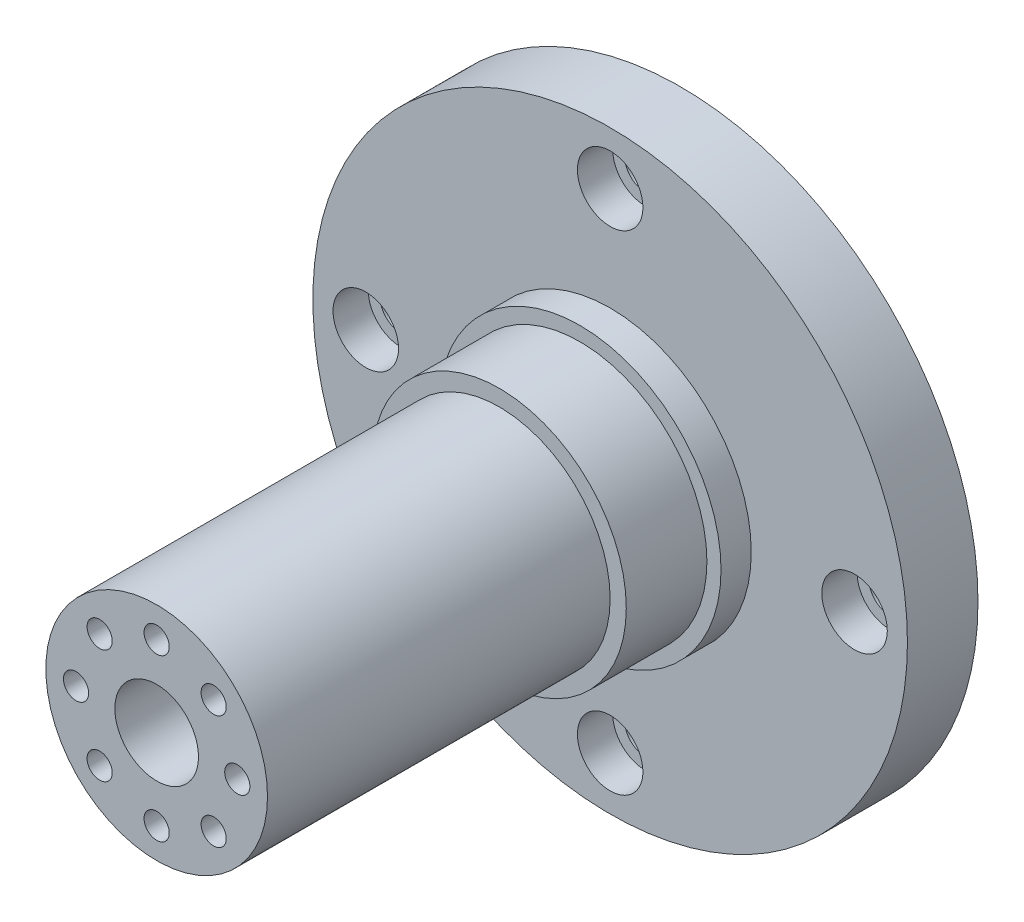
ISO-10303-21;
HEADER;
FILE_DESCRIPTION(('STEP AP214'),'2;1');
FILE_NAME('part.step','',(''),(''),'','','');
FILE_SCHEMA(('AUTOMOTIVE_DESIGN { 1 0 10303 214 1 1 1 1 }'));
ENDSEC;
DATA;
#1=APPLICATION_CONTEXT('core data for automotive mechanical design processes');
#2=APPLICATION_PROTOCOL_DEFINITION('international standard','automotive_design',2000,#1);
#3=PRODUCT_CONTEXT('',#1,'mechanical');
#4=PRODUCT('Part','Part','',(#3));
#5=PRODUCT_RELATED_PRODUCT_CATEGORY('part','',(#4));
#6=PRODUCT_DEFINITION_FORMATION('','',#4);
#7=PRODUCT_DEFINITION_CONTEXT('part definition',#1,'design');
#8=PRODUCT_DEFINITION('design','',#6,#7);
#9=PRODUCT_DEFINITION_SHAPE('','',#8);
#10=(LENGTH_UNIT() NAMED_UNIT(*) SI_UNIT(.MILLI.,.METRE.));
#11=(NAMED_UNIT(*) PLANE_ANGLE_UNIT() SI_UNIT($,.RADIAN.));
#12=(NAMED_UNIT(*) SI_UNIT($,.STERADIAN.) SOLID_ANGLE_UNIT());
#13=UNCERTAINTY_MEASURE_WITH_UNIT(LENGTH_MEASURE(1.E-05),#10,'distance_accuracy_value','');
#14=(GEOMETRIC_REPRESENTATION_CONTEXT(3) GLOBAL_UNCERTAINTY_ASSIGNED_CONTEXT((#13)) GLOBAL_UNIT_ASSIGNED_CONTEXT((#10,
#11,#12)) REPRESENTATION_CONTEXT('',''));
#15=CARTESIAN_POINT('',(0.,0.,0.));
#16=DIRECTION('',(0.,0.,1.));
#17=DIRECTION('',(1.,0.,0.));
#18=AXIS2_PLACEMENT_3D('',#15,#16,#17);
#19=CARTESIAN_POINT('',(0.,0.,7.));
#20=DIRECTION('',(0.,0.,-1.));
#21=DIRECTION('',(-1.,0.,0.));
#22=AXIS2_PLACEMENT_3D('',#19,#20,#21);
#23=CYLINDRICAL_SURFACE('',#22,29.5);
#24=CARTESIAN_POINT('',(0.,0.,7.));
#25=DIRECTION('',(0.,0.,1.));
#26=DIRECTION('',(1.,0.,0.));
#27=AXIS2_PLACEMENT_3D('',#24,#25,#26);
#28=CIRCLE('',#27,29.5);
#29=CARTESIAN_POINT('',(29.5,0.,7.));
#30=VERTEX_POINT('',#29);
#31=EDGE_CURVE('E73',#30,#30,#28,.T.);
#32=ORIENTED_EDGE('',*,*,#31,.F.);
#33=EDGE_LOOP('',(#32));
#34=FACE_BOUND('',#33,.T.);
#35=CARTESIAN_POINT('',(0.,0.,0.));
#36=DIRECTION('',(0.,0.,1.));
#37=DIRECTION('',(1.,0.,0.));
#38=AXIS2_PLACEMENT_3D('',#35,#36,#37);
#39=CIRCLE('',#38,29.5);
#40=CARTESIAN_POINT('',(29.5,0.,0.));
#41=VERTEX_POINT('',#40);
#42=EDGE_CURVE('E46',#41,#41,#39,.T.);
#43=ORIENTED_EDGE('',*,*,#42,.T.);
#44=EDGE_LOOP('',(#43));
#45=FACE_BOUND('',#44,.T.);
#46=ADVANCED_FACE('F43',(#34,#45),#23,.T.);
#47=CARTESIAN_POINT('',(0.,0.,7.));
#48=DIRECTION('',(0.,0.,1.));
#49=DIRECTION('',(1.,0.,0.));
#50=AXIS2_PLACEMENT_3D('',#47,#48,#49);
#51=PLANE('',#50);
#52=CARTESIAN_POINT('',(-24.25,0.,7.));
#53=DIRECTION('',(0.,0.,1.));
#54=DIRECTION('',(1.,0.,0.));
#55=AXIS2_PLACEMENT_3D('',#52,#53,#54);
#56=CIRCLE('',#55,3.25);
#57=CARTESIAN_POINT('',(-21.,0.,7.));
#58=VERTEX_POINT('',#57);
#59=EDGE_CURVE('E664',#58,#58,#56,.T.);
#60=ORIENTED_EDGE('',*,*,#59,.F.);
#61=EDGE_LOOP('',(#60));
#62=FACE_BOUND('',#61,.T.);
#63=CARTESIAN_POINT('',(0.,24.25,7.));
#64=DIRECTION('',(0.,0.,1.));
#65=DIRECTION('',(1.,0.,0.));
#66=AXIS2_PLACEMENT_3D('',#63,#64,#65);
#67=CIRCLE('',#66,3.25);
#68=CARTESIAN_POINT('',(3.25000000000009,24.25,7.));
#69=VERTEX_POINT('',#68);
#70=EDGE_CURVE('E668',#69,#69,#67,.T.);
#71=ORIENTED_EDGE('',*,*,#70,.F.);
#72=EDGE_LOOP('',(#71));
#73=FACE_BOUND('',#72,.T.);
#74=CARTESIAN_POINT('',(24.25,-1.69336844933892E-13,7.));
#75=DIRECTION('',(0.,0.,1.));
#76=DIRECTION('',(1.,0.,0.));
#77=AXIS2_PLACEMENT_3D('',#74,#75,#76);
#78=CIRCLE('',#77,3.25);
#79=CARTESIAN_POINT('',(27.5,-1.69336844933892E-13,7.));
#80=VERTEX_POINT('',#79);
#81=EDGE_CURVE('E676',#80,#80,#78,.T.);
#82=ORIENTED_EDGE('',*,*,#81,.F.);
#83=EDGE_LOOP('',(#82));
#84=FACE_BOUND('',#83,.T.);
#85=CARTESIAN_POINT('',(-2.54005267400838E-13,-24.25,7.));
#86=DIRECTION('',(0.,0.,1.));
#87=DIRECTION('',(1.,0.,0.));
#88=AXIS2_PLACEMENT_3D('',#85,#86,#87);
#89=CIRCLE('',#88,3.25);
#90=CARTESIAN_POINT('',(3.24999999999975,-24.25,7.));
#91=VERTEX_POINT('',#90);
#92=EDGE_CURVE('E510',#91,#91,#89,.T.);
#93=ORIENTED_EDGE('',*,*,#92,.F.);
#94=EDGE_LOOP('',(#93));
#95=FACE_BOUND('',#94,.T.);
#96=CARTESIAN_POINT('',(0.,0.,7.));
#97=DIRECTION('',(0.,0.,1.));
#98=DIRECTION('',(1.,0.,0.));
#99=AXIS2_PLACEMENT_3D('',#96,#97,#98);
#100=CIRCLE('',#99,14.);
#101=CARTESIAN_POINT('',(14.,0.,7.));
#102=VERTEX_POINT('',#101);
#103=EDGE_CURVE('E57',#102,#102,#100,.T.);
#104=ORIENTED_EDGE('',*,*,#103,.F.);
#105=EDGE_LOOP('',(#104));
#106=FACE_BOUND('',#105,.T.);
#107=ORIENTED_EDGE('',*,*,#31,.T.);
#108=EDGE_LOOP('',(#107));
#109=FACE_BOUND('',#108,.T.);
#110=ADVANCED_FACE('F86',(#62,#73,#84,#95,#106,#109),#51,.T.);
#111=CARTESIAN_POINT('',(0.,0.,0.));
#112=DIRECTION('',(0.,0.,1.));
#113=DIRECTION('',(1.,0.,0.));
#114=AXIS2_PLACEMENT_3D('',#111,#112,#113);
#115=PLANE('',#114);
#116=CARTESIAN_POINT('',(0.,24.25,0.));
#117=DIRECTION('',(0.,0.,1.));
#118=DIRECTION('',(1.,0.,0.));
#119=AXIS2_PLACEMENT_3D('',#116,#117,#118);
#120=CIRCLE('',#119,2.07);
#121=CARTESIAN_POINT('',(2.07000000000008,24.25,0.));
#122=VERTEX_POINT('',#121);
#123=EDGE_CURVE('E511',#122,#122,#120,.T.);
#124=ORIENTED_EDGE('',*,*,#123,.T.);
#125=EDGE_LOOP('',(#124));
#126=FACE_BOUND('',#125,.T.);
#127=CARTESIAN_POINT('',(24.25,-1.72806291885846E-13,0.));
#128=DIRECTION('',(0.,0.,1.));
#129=DIRECTION('',(1.,0.,0.));
#130=AXIS2_PLACEMENT_3D('',#127,#128,#129);
#131=CIRCLE('',#130,2.07);
#132=CARTESIAN_POINT('',(26.32,-1.72806291885846E-13,0.));
#133=VERTEX_POINT('',#132);
#134=EDGE_CURVE('E699',#133,#133,#131,.T.);
#135=ORIENTED_EDGE('',*,*,#134,.T.);
#136=EDGE_LOOP('',(#135));
#137=FACE_BOUND('',#136,.T.);
#138=CARTESIAN_POINT('',(-2.54005267400838E-13,-24.25,0.));
#139=DIRECTION('',(0.,0.,1.));
#140=DIRECTION('',(1.,0.,0.));
#141=AXIS2_PLACEMENT_3D('',#138,#139,#140);
#142=CIRCLE('',#141,2.07);
#143=CARTESIAN_POINT('',(2.06999999999975,-24.25,0.));
#144=VERTEX_POINT('',#143);
#145=EDGE_CURVE('E693',#144,#144,#142,.T.);
#146=ORIENTED_EDGE('',*,*,#145,.T.);
#147=EDGE_LOOP('',(#146));
#148=FACE_BOUND('',#147,.T.);
#149=CARTESIAN_POINT('',(-24.25,3.42143136819738E-13,0.));
#150=DIRECTION('',(0.,0.,1.));
#151=DIRECTION('',(1.,0.,0.));
#152=AXIS2_PLACEMENT_3D('',#149,#150,#151);
#153=CIRCLE('',#152,2.07);
#154=CARTESIAN_POINT('',(-22.18,3.42143136819738E-13,0.));
#155=VERTEX_POINT('',#154);
#156=EDGE_CURVE('E685',#155,#155,#153,.T.);
#157=ORIENTED_EDGE('',*,*,#156,.T.);
#158=EDGE_LOOP('',(#157));
#159=FACE_BOUND('',#158,.T.);
#160=CARTESIAN_POINT('',(8.,0.,0.));
#161=DIRECTION('',(0.,0.,-1.));
#162=DIRECTION('',(-1.,0.,0.));
#163=AXIS2_PLACEMENT_3D('',#160,#161,#162);
#164=CIRCLE('',#163,2.1);
#165=CARTESIAN_POINT('',(5.9,0.,0.));
#166=VERTEX_POINT('',#165);
#167=EDGE_CURVE('E620',#166,#166,#164,.T.);
#168=ORIENTED_EDGE('',*,*,#167,.F.);
#169=EDGE_LOOP('',(#168));
#170=FACE_BOUND('',#169,.T.);
#171=CARTESIAN_POINT('',(5.65685424949233,5.65685424949243,0.));
#172=DIRECTION('',(0.,0.,-1.));
#173=DIRECTION('',(-1.,0.,0.));
#174=AXIS2_PLACEMENT_3D('',#171,#172,#173);
#175=CIRCLE('',#174,2.1);
#176=CARTESIAN_POINT('',(3.55685424949233,5.65685424949243,0.));
#177=VERTEX_POINT('',#176);
#178=EDGE_CURVE('E629',#177,#177,#175,.T.);
#179=ORIENTED_EDGE('',*,*,#178,.F.);
#180=EDGE_LOOP('',(#179));
#181=FACE_BOUND('',#180,.T.);
#182=CARTESIAN_POINT('',(0.,8.,0.));
#183=DIRECTION('',(0.,0.,-1.));
#184=DIRECTION('',(-1.,0.,0.));
#185=AXIS2_PLACEMENT_3D('',#182,#183,#184);
#186=CIRCLE('',#185,2.1);
#187=CARTESIAN_POINT('',(-2.10000000000009,8.,0.));
#188=VERTEX_POINT('',#187);
#189=EDGE_CURVE('E637',#188,#188,#186,.T.);
#190=ORIENTED_EDGE('',*,*,#189,.F.);
#191=EDGE_LOOP('',(#190));
#192=FACE_BOUND('',#191,.T.);
#193=CARTESIAN_POINT('',(-5.65685424949245,5.65685424949231,0.));
#194=DIRECTION('',(0.,0.,-1.));
#195=DIRECTION('',(-1.,0.,0.));
#196=AXIS2_PLACEMENT_3D('',#193,#194,#195);
#197=CIRCLE('',#196,2.1);
#198=CARTESIAN_POINT('',(-7.75685424949245,5.65685424949231,0.));
#199=VERTEX_POINT('',#198);
#200=EDGE_CURVE('E645',#199,#199,#197,.T.);
#201=ORIENTED_EDGE('',*,*,#200,.F.);
#202=EDGE_LOOP('',(#201));
#203=FACE_BOUND('',#202,.T.);
#204=CARTESIAN_POINT('',(-8.,0.,0.));
#205=DIRECTION('',(0.,0.,-1.));
#206=DIRECTION('',(-1.,0.,0.));
#207=AXIS2_PLACEMENT_3D('',#204,#205,#206);
#208=CIRCLE('',#207,2.1);
#209=CARTESIAN_POINT('',(-10.1,0.,0.));
#210=VERTEX_POINT('',#209);
#211=EDGE_CURVE('E596',#210,#210,#208,.T.);
#212=ORIENTED_EDGE('',*,*,#211,.F.);
#213=EDGE_LOOP('',(#212));
#214=FACE_BOUND('',#213,.T.);
#215=CARTESIAN_POINT('',(-5.65685424949237,-5.65685424949239,0.));
#216=DIRECTION('',(0.,0.,-1.));
#217=DIRECTION('',(-1.,0.,0.));
#218=AXIS2_PLACEMENT_3D('',#215,#216,#217);
#219=CIRCLE('',#218,2.1);
#220=CARTESIAN_POINT('',(-7.75685424949237,-5.65685424949239,0.));
#221=VERTEX_POINT('',#220);
#222=EDGE_CURVE('E605',#221,#221,#219,.T.);
#223=ORIENTED_EDGE('',*,*,#222,.F.);
#224=EDGE_LOOP('',(#223));
#225=FACE_BOUND('',#224,.T.);
#226=CARTESIAN_POINT('',(0.,-8.,0.));
#227=DIRECTION('',(0.,0.,-1.));
#228=DIRECTION('',(-1.,0.,0.));
#229=AXIS2_PLACEMENT_3D('',#226,#227,#228);
#230=CIRCLE('',#229,2.1);
#231=CARTESIAN_POINT('',(-2.09999999999997,-8.,0.));
#232=VERTEX_POINT('',#231);
#233=EDGE_CURVE('E613',#232,#232,#230,.T.);
#234=ORIENTED_EDGE('',*,*,#233,.F.);
#235=EDGE_LOOP('',(#234));
#236=FACE_BOUND('',#235,.T.);
#237=CARTESIAN_POINT('',(5.65685424949241,-5.65685424949235,0.));
#238=DIRECTION('',(0.,0.,-1.));
#239=DIRECTION('',(-1.,0.,0.));
#240=AXIS2_PLACEMENT_3D('',#237,#238,#239);
#241=CIRCLE('',#240,2.1);
#242=CARTESIAN_POINT('',(3.55685424949241,-5.65685424949235,0.));
#243=VERTEX_POINT('',#242);
#244=EDGE_CURVE('E624',#243,#243,#241,.T.);
#245=ORIENTED_EDGE('',*,*,#244,.F.);
#246=EDGE_LOOP('',(#245));
#247=FACE_BOUND('',#246,.T.);
#248=ORIENTED_EDGE('',*,*,#42,.F.);
#249=EDGE_LOOP('',(#248));
#250=FACE_BOUND('',#249,.T.);
#251=ADVANCED_FACE('F83',(#126,#137,#148,#159,#170,#181,#192,#203,#214,#225,#236,#247,#250),
#115,.F.);
#252=CARTESIAN_POINT('',(0.,0.,10.));
#253=DIRECTION('',(0.,0.,-1.));
#254=DIRECTION('',(-1.,0.,0.));
#255=AXIS2_PLACEMENT_3D('',#252,#253,#254);
#256=CYLINDRICAL_SURFACE('',#255,14.);
#257=CARTESIAN_POINT('',(0.,0.,10.));
#258=DIRECTION('',(0.,0.,1.));
#259=DIRECTION('',(1.,0.,0.));
#260=AXIS2_PLACEMENT_3D('',#257,#258,#259);
#261=CIRCLE('',#260,14.);
#262=CARTESIAN_POINT('',(14.,0.,10.));
#263=VERTEX_POINT('',#262);
#264=EDGE_CURVE('E66',#263,#263,#261,.T.);
#265=ORIENTED_EDGE('',*,*,#264,.F.);
#266=EDGE_LOOP('',(#265));
#267=FACE_BOUND('',#266,.T.);
#268=ORIENTED_EDGE('',*,*,#103,.T.);
#269=EDGE_LOOP('',(#268));
#270=FACE_BOUND('',#269,.T.);
#271=ADVANCED_FACE('F85',(#267,#270),#256,.T.);
#272=CARTESIAN_POINT('',(0.,0.,10.));
#273=DIRECTION('',(0.,0.,1.));
#274=DIRECTION('',(1.,0.,0.));
#275=AXIS2_PLACEMENT_3D('',#272,#273,#274);
#276=PLANE('',#275);
#277=CARTESIAN_POINT('',(0.,0.,10.));
#278=DIRECTION('',(0.,0.,1.));
#279=DIRECTION('',(1.,0.,0.));
#280=AXIS2_PLACEMENT_3D('',#277,#278,#279);
#281=CIRCLE('',#280,12.6);
#282=CARTESIAN_POINT('',(12.6,0.,10.));
#283=VERTEX_POINT('',#282);
#284=EDGE_CURVE('E51',#283,#283,#281,.T.);
#285=ORIENTED_EDGE('',*,*,#284,.F.);
#286=EDGE_LOOP('',(#285));
#287=FACE_BOUND('',#286,.T.);
#288=ORIENTED_EDGE('',*,*,#264,.T.);
#289=EDGE_LOOP('',(#288));
#290=FACE_BOUND('',#289,.T.);
#291=ADVANCED_FACE('F93',(#287,#290),#276,.T.);
#292=CARTESIAN_POINT('',(0.,0.,18.));
#293=DIRECTION('',(0.,0.,-1.));
#294=DIRECTION('',(-1.,0.,0.));
#295=AXIS2_PLACEMENT_3D('',#292,#293,#294);
#296=CYLINDRICAL_SURFACE('',#295,12.6);
#297=CARTESIAN_POINT('',(0.,0.,18.));
#298=DIRECTION('',(0.,0.,1.));
#299=DIRECTION('',(1.,0.,0.));
#300=AXIS2_PLACEMENT_3D('',#297,#298,#299);
#301=CIRCLE('',#300,12.6);
#302=CARTESIAN_POINT('',(12.6,0.,18.));
#303=VERTEX_POINT('',#302);
#304=EDGE_CURVE('E63',#303,#303,#301,.T.);
#305=ORIENTED_EDGE('',*,*,#304,.F.);
#306=EDGE_LOOP('',(#305));
#307=FACE_BOUND('',#306,.T.);
#308=ORIENTED_EDGE('',*,*,#284,.T.);
#309=EDGE_LOOP('',(#308));
#310=FACE_BOUND('',#309,.T.);
#311=ADVANCED_FACE('F118',(#307,#310),#296,.T.);
#312=CARTESIAN_POINT('',(0.,0.,18.));
#313=DIRECTION('',(0.,0.,1.));
#314=DIRECTION('',(1.,0.,0.));
#315=AXIS2_PLACEMENT_3D('',#312,#313,#314);
#316=PLANE('',#315);
#317=CARTESIAN_POINT('',(0.,0.,18.));
#318=DIRECTION('',(0.,0.,1.));
#319=DIRECTION('',(1.,0.,0.));
#320=AXIS2_PLACEMENT_3D('',#317,#318,#319);
#321=CIRCLE('',#320,11.);
#322=CARTESIAN_POINT('',(11.,0.,18.));
#323=VERTEX_POINT('',#322);
#324=EDGE_CURVE('E10',#323,#323,#321,.T.);
#325=ORIENTED_EDGE('',*,*,#324,.F.);
#326=EDGE_LOOP('',(#325));
#327=FACE_BOUND('',#326,.T.);
#328=ORIENTED_EDGE('',*,*,#304,.T.);
#329=EDGE_LOOP('',(#328));
#330=FACE_BOUND('',#329,.T.);
#331=ADVANCED_FACE('F127',(#327,#330),#316,.T.);
#332=CARTESIAN_POINT('',(0.,0.,52.));
#333=DIRECTION('',(0.,0.,-1.));
#334=DIRECTION('',(-1.,0.,0.));
#335=AXIS2_PLACEMENT_3D('',#332,#333,#334);
#336=CYLINDRICAL_SURFACE('',#335,11.);
#337=CARTESIAN_POINT('',(0.,0.,52.));
#338=DIRECTION('',(0.,0.,1.));
#339=DIRECTION('',(1.,0.,0.));
#340=AXIS2_PLACEMENT_3D('',#337,#338,#339);
#341=CIRCLE('',#340,11.);
#342=CARTESIAN_POINT('',(11.,0.,52.));
#343=VERTEX_POINT('',#342);
#344=EDGE_CURVE('E61',#343,#343,#341,.T.);
#345=ORIENTED_EDGE('',*,*,#344,.F.);
#346=EDGE_LOOP('',(#345));
#347=FACE_BOUND('',#346,.T.);
#348=ORIENTED_EDGE('',*,*,#324,.T.);
#349=EDGE_LOOP('',(#348));
#350=FACE_BOUND('',#349,.T.);
#351=ADVANCED_FACE('F136',(#347,#350),#336,.T.);
#352=CARTESIAN_POINT('',(0.,0.,52.));
#353=DIRECTION('',(0.,0.,1.));
#354=DIRECTION('',(1.,0.,0.));
#355=AXIS2_PLACEMENT_3D('',#352,#353,#354);
#356=PLANE('',#355);
#357=CARTESIAN_POINT('',(0.,0.,52.));
#358=DIRECTION('',(0.,0.,1.));
#359=DIRECTION('',(1.,0.,0.));
#360=AXIS2_PLACEMENT_3D('',#357,#358,#359);
#361=CIRCLE('',#360,4.15);
#362=CARTESIAN_POINT('',(4.15,0.,52.));
#363=VERTEX_POINT('',#362);
#364=EDGE_CURVE('E527',#363,#363,#361,.T.);
#365=ORIENTED_EDGE('',*,*,#364,.F.);
#366=EDGE_LOOP('',(#365));
#367=FACE_BOUND('',#366,.T.);
#368=CARTESIAN_POINT('',(5.65685424949249,-5.65685424949227,52.));
#369=DIRECTION('',(0.,0.,-1.));
#370=DIRECTION('',(-1.,0.,0.));
#371=AXIS2_PLACEMENT_3D('',#368,#369,#370);
#372=CIRCLE('',#371,1.25);
#373=CARTESIAN_POINT('',(4.40685424949249,-5.65685424949227,52.));
#374=VERTEX_POINT('',#373);
#375=EDGE_CURVE('E526',#374,#374,#372,.T.);
#376=ORIENTED_EDGE('',*,*,#375,.T.);
#377=EDGE_LOOP('',(#376));
#378=FACE_BOUND('',#377,.T.);
#379=CARTESIAN_POINT('',(1.41393977029702E-13,-8.,52.));
#380=DIRECTION('',(0.,0.,-1.));
#381=DIRECTION('',(-1.,0.,0.));
#382=AXIS2_PLACEMENT_3D('',#379,#380,#381);
#383=CIRCLE('',#382,1.25);
#384=CARTESIAN_POINT('',(-1.24999999999986,-8.,52.));
#385=VERTEX_POINT('',#384);
#386=EDGE_CURVE('E577',#385,#385,#383,.T.);
#387=ORIENTED_EDGE('',*,*,#386,.T.);
#388=EDGE_LOOP('',(#387));
#389=FACE_BOUND('',#388,.T.);
#390=CARTESIAN_POINT('',(-5.65685424949229,-5.65685424949247,52.));
#391=DIRECTION('',(0.,0.,-1.));
#392=DIRECTION('',(-1.,0.,0.));
#393=AXIS2_PLACEMENT_3D('',#390,#391,#392);
#394=CIRCLE('',#393,1.25);
#395=CARTESIAN_POINT('',(-6.90685424949229,-5.65685424949247,52.));
#396=VERTEX_POINT('',#395);
#397=EDGE_CURVE('E569',#396,#396,#394,.T.);
#398=ORIENTED_EDGE('',*,*,#397,.T.);
#399=EDGE_LOOP('',(#398));
#400=FACE_BOUND('',#399,.T.);
#401=CARTESIAN_POINT('',(-8.,-1.1172740284298E-13,52.));
#402=DIRECTION('',(0.,0.,-1.));
#403=DIRECTION('',(-1.,0.,0.));
#404=AXIS2_PLACEMENT_3D('',#401,#402,#403);
#405=CIRCLE('',#404,1.25);
#406=CARTESIAN_POINT('',(-9.25,-1.1172740284298E-13,52.));
#407=VERTEX_POINT('',#406);
#408=EDGE_CURVE('E561',#407,#407,#405,.T.);
#409=ORIENTED_EDGE('',*,*,#408,.T.);
#410=EDGE_LOOP('',(#409));
#411=FACE_BOUND('',#410,.T.);
#412=CARTESIAN_POINT('',(-5.65685424949245,5.65685424949231,52.));
#413=DIRECTION('',(0.,0.,-1.));
#414=DIRECTION('',(-1.,0.,0.));
#415=AXIS2_PLACEMENT_3D('',#412,#413,#414);
#416=CIRCLE('',#415,1.25);
#417=CARTESIAN_POINT('',(-6.90685424949245,5.65685424949231,52.));
#418=VERTEX_POINT('',#417);
#419=EDGE_CURVE('E553',#418,#418,#416,.T.);
#420=ORIENTED_EDGE('',*,*,#419,.T.);
#421=EDGE_LOOP('',(#420));
#422=FACE_BOUND('',#421,.T.);
#423=CARTESIAN_POINT('',(0.,8.,52.));
#424=DIRECTION('',(0.,0.,-1.));
#425=DIRECTION('',(-1.,0.,0.));
#426=AXIS2_PLACEMENT_3D('',#423,#424,#425);
#427=CIRCLE('',#426,1.25);
#428=CARTESIAN_POINT('',(-1.25000000000008,8.,52.));
#429=VERTEX_POINT('',#428);
#430=EDGE_CURVE('E545',#429,#429,#427,.T.);
#431=ORIENTED_EDGE('',*,*,#430,.T.);
#432=EDGE_LOOP('',(#431));
#433=FACE_BOUND('',#432,.T.);
#434=CARTESIAN_POINT('',(5.65685424949233,5.65685424949243,52.));
#435=DIRECTION('',(0.,0.,-1.));
#436=DIRECTION('',(-1.,0.,0.));
#437=AXIS2_PLACEMENT_3D('',#434,#435,#436);
#438=CIRCLE('',#437,1.25);
#439=CARTESIAN_POINT('',(4.40685424949233,5.65685424949243,52.));
#440=VERTEX_POINT('',#439);
#441=EDGE_CURVE('E537',#440,#440,#438,.T.);
#442=ORIENTED_EDGE('',*,*,#441,.T.);
#443=EDGE_LOOP('',(#442));
#444=FACE_BOUND('',#443,.T.);
#445=CARTESIAN_POINT('',(8.,0.,52.));
#446=DIRECTION('',(0.,0.,-1.));
#447=DIRECTION('',(-1.,0.,0.));
#448=AXIS2_PLACEMENT_3D('',#445,#446,#447);
#449=CIRCLE('',#448,1.25);
#450=CARTESIAN_POINT('',(6.75,0.,52.));
#451=VERTEX_POINT('',#450);
#452=EDGE_CURVE('E588',#451,#451,#449,.T.);
#453=ORIENTED_EDGE('',*,*,#452,.T.);
#454=EDGE_LOOP('',(#453));
#455=FACE_BOUND('',#454,.T.);
#456=ORIENTED_EDGE('',*,*,#344,.T.);
#457=EDGE_LOOP('',(#456));
#458=FACE_BOUND('',#457,.T.);
#459=ADVANCED_FACE('F145',(#367,#378,#389,#400,#411,#422,#433,#444,#455,#458),#356,.T.);
#460=CARTESIAN_POINT('',(5.65685424949241,-5.65685424949235,33.8));
#461=DIRECTION('',(0.,0.,-1.));
#462=DIRECTION('',(-1.,0.,0.));
#463=AXIS2_PLACEMENT_3D('',#460,#461,#462);
#464=CYLINDRICAL_SURFACE('',#463,2.1);
#465=CARTESIAN_POINT('',(5.65685424949241,-5.65685424949235,33.8));
#466=DIRECTION('',(0.,0.,-1.));
#467=DIRECTION('',(-1.,0.,0.));
#468=AXIS2_PLACEMENT_3D('',#465,#466,#467);
#469=CIRCLE('',#468,2.1);
#470=CARTESIAN_POINT('',(3.55685424949241,-5.65685424949235,33.8));
#471=VERTEX_POINT('',#470);
#472=EDGE_CURVE('E652',#471,#471,#469,.T.);
#473=ORIENTED_EDGE('',*,*,#472,.F.);
#474=EDGE_LOOP('',(#473));
#475=FACE_BOUND('',#474,.T.);
#476=ORIENTED_EDGE('',*,*,#244,.T.);
#477=EDGE_LOOP('',(#476));
#478=FACE_BOUND('',#477,.T.);
#479=ADVANCED_FACE('F152',(#475,#478),#464,.F.);
#480=CARTESIAN_POINT('',(5.65685424949241,-5.65685424949235,33.8));
#481=DIRECTION('',(0.,0.,-1.));
#482=DIRECTION('',(-1.,0.,0.));
#483=AXIS2_PLACEMENT_3D('',#480,#481,#482);
#484=PLANE('',#483);
#485=CARTESIAN_POINT('',(5.65685424949249,-5.65685424949227,33.8));
#486=DIRECTION('',(0.,0.,-1.));
#487=DIRECTION('',(-1.,0.,0.));
#488=AXIS2_PLACEMENT_3D('',#485,#486,#487);
#489=CIRCLE('',#488,1.25);
#490=CARTESIAN_POINT('',(4.40685424949249,-5.65685424949227,33.8));
#491=VERTEX_POINT('',#490);
#492=EDGE_CURVE('E581',#491,#491,#489,.T.);
#493=ORIENTED_EDGE('',*,*,#492,.F.);
#494=EDGE_LOOP('',(#493));
#495=FACE_BOUND('',#494,.T.);
#496=ORIENTED_EDGE('',*,*,#472,.T.);
#497=EDGE_LOOP('',(#496));
#498=FACE_BOUND('',#497,.T.);
#499=ADVANCED_FACE('F156',(#495,#498),#484,.T.);
#500=CARTESIAN_POINT('',(0.,-8.,33.8));
#501=DIRECTION('',(0.,0.,-1.));
#502=DIRECTION('',(-1.,0.,0.));
#503=AXIS2_PLACEMENT_3D('',#500,#501,#502);
#504=CYLINDRICAL_SURFACE('',#503,2.1);
#505=CARTESIAN_POINT('',(0.,-8.,33.8));
#506=DIRECTION('',(0.,0.,-1.));
#507=DIRECTION('',(-1.,0.,0.));
#508=AXIS2_PLACEMENT_3D('',#505,#506,#507);
#509=CIRCLE('',#508,2.1);
#510=CARTESIAN_POINT('',(-2.09999999999997,-8.,33.8));
#511=VERTEX_POINT('',#510);
#512=EDGE_CURVE('E592',#511,#511,#509,.T.);
#513=ORIENTED_EDGE('',*,*,#512,.F.);
#514=EDGE_LOOP('',(#513));
#515=FACE_BOUND('',#514,.T.);
#516=ORIENTED_EDGE('',*,*,#233,.T.);
#517=EDGE_LOOP('',(#516));
#518=FACE_BOUND('',#517,.T.);
#519=ADVANCED_FACE('F163',(#515,#518),#504,.F.);
#520=CARTESIAN_POINT('',(0.,-8.,33.8));
#521=DIRECTION('',(0.,0.,-1.));
#522=DIRECTION('',(-1.,0.,0.));
#523=AXIS2_PLACEMENT_3D('',#520,#521,#522);
#524=PLANE('',#523);
#525=CARTESIAN_POINT('',(1.41393977029702E-13,-8.,33.8));
#526=DIRECTION('',(0.,0.,-1.));
#527=DIRECTION('',(-1.,0.,0.));
#528=AXIS2_PLACEMENT_3D('',#525,#526,#527);
#529=CIRCLE('',#528,1.25);
#530=CARTESIAN_POINT('',(-1.24999999999986,-8.,33.8));
#531=VERTEX_POINT('',#530);
#532=EDGE_CURVE('E573',#531,#531,#529,.T.);
#533=ORIENTED_EDGE('',*,*,#532,.F.);
#534=EDGE_LOOP('',(#533));
#535=FACE_BOUND('',#534,.T.);
#536=ORIENTED_EDGE('',*,*,#512,.T.);
#537=EDGE_LOOP('',(#536));
#538=FACE_BOUND('',#537,.T.);
#539=ADVANCED_FACE('F167',(#535,#538),#524,.T.);
#540=CARTESIAN_POINT('',(-5.65685424949237,-5.65685424949239,33.8));
#541=DIRECTION('',(0.,0.,-1.));
#542=DIRECTION('',(-1.,0.,0.));
#543=AXIS2_PLACEMENT_3D('',#540,#541,#542);
#544=CYLINDRICAL_SURFACE('',#543,2.1);
#545=CARTESIAN_POINT('',(-5.65685424949237,-5.65685424949239,33.8));
#546=DIRECTION('',(0.,0.,-1.));
#547=DIRECTION('',(-1.,0.,0.));
#548=AXIS2_PLACEMENT_3D('',#545,#546,#547);
#549=CIRCLE('',#548,2.1);
#550=CARTESIAN_POINT('',(-7.75685424949237,-5.65685424949239,33.8));
#551=VERTEX_POINT('',#550);
#552=EDGE_CURVE('E609',#551,#551,#549,.T.);
#553=ORIENTED_EDGE('',*,*,#552,.F.);
#554=EDGE_LOOP('',(#553));
#555=FACE_BOUND('',#554,.T.);
#556=ORIENTED_EDGE('',*,*,#222,.T.);
#557=EDGE_LOOP('',(#556));
#558=FACE_BOUND('',#557,.T.);
#559=ADVANCED_FACE('F174',(#555,#558),#544,.F.);
#560=CARTESIAN_POINT('',(-5.65685424949237,-5.65685424949239,33.8));
#561=DIRECTION('',(0.,0.,-1.));
#562=DIRECTION('',(-1.,0.,0.));
#563=AXIS2_PLACEMENT_3D('',#560,#561,#562);
#564=PLANE('',#563);
#565=CARTESIAN_POINT('',(-5.65685424949229,-5.65685424949247,33.8));
#566=DIRECTION('',(0.,0.,-1.));
#567=DIRECTION('',(-1.,0.,0.));
#568=AXIS2_PLACEMENT_3D('',#565,#566,#567);
#569=CIRCLE('',#568,1.25);
#570=CARTESIAN_POINT('',(-6.90685424949229,-5.65685424949247,33.8));
#571=VERTEX_POINT('',#570);
#572=EDGE_CURVE('E565',#571,#571,#569,.T.);
#573=ORIENTED_EDGE('',*,*,#572,.F.);
#574=EDGE_LOOP('',(#573));
#575=FACE_BOUND('',#574,.T.);
#576=ORIENTED_EDGE('',*,*,#552,.T.);
#577=EDGE_LOOP('',(#576));
#578=FACE_BOUND('',#577,.T.);
#579=ADVANCED_FACE('F178',(#575,#578),#564,.T.);
#580=CARTESIAN_POINT('',(-8.,0.,33.8));
#581=DIRECTION('',(0.,0.,-1.));
#582=DIRECTION('',(-1.,0.,0.));
#583=AXIS2_PLACEMENT_3D('',#580,#581,#582);
#584=CYLINDRICAL_SURFACE('',#583,2.1);
#585=CARTESIAN_POINT('',(-8.,0.,33.8));
#586=DIRECTION('',(0.,0.,-1.));
#587=DIRECTION('',(-1.,0.,0.));
#588=AXIS2_PLACEMENT_3D('',#585,#586,#587);
#589=CIRCLE('',#588,2.1);
#590=CARTESIAN_POINT('',(-10.1,0.,33.8));
#591=VERTEX_POINT('',#590);
#592=EDGE_CURVE('E601',#591,#591,#589,.T.);
#593=ORIENTED_EDGE('',*,*,#592,.F.);
#594=EDGE_LOOP('',(#593));
#595=FACE_BOUND('',#594,.T.);
#596=ORIENTED_EDGE('',*,*,#211,.T.);
#597=EDGE_LOOP('',(#596));
#598=FACE_BOUND('',#597,.T.);
#599=ADVANCED_FACE('F185',(#595,#598),#584,.F.);
#600=CARTESIAN_POINT('',(-8.,0.,33.8));
#601=DIRECTION('',(0.,0.,-1.));
#602=DIRECTION('',(-1.,0.,0.));
#603=AXIS2_PLACEMENT_3D('',#600,#601,#602);
#604=PLANE('',#603);
#605=CARTESIAN_POINT('',(-8.,-1.1172740284298E-13,33.8));
#606=DIRECTION('',(0.,0.,-1.));
#607=DIRECTION('',(-1.,0.,0.));
#608=AXIS2_PLACEMENT_3D('',#605,#606,#607);
#609=CIRCLE('',#608,1.25);
#610=CARTESIAN_POINT('',(-9.25,-1.1172740284298E-13,33.8));
#611=VERTEX_POINT('',#610);
#612=EDGE_CURVE('E557',#611,#611,#609,.T.);
#613=ORIENTED_EDGE('',*,*,#612,.F.);
#614=EDGE_LOOP('',(#613));
#615=FACE_BOUND('',#614,.T.);
#616=ORIENTED_EDGE('',*,*,#592,.T.);
#617=EDGE_LOOP('',(#616));
#618=FACE_BOUND('',#617,.T.);
#619=ADVANCED_FACE('F189',(#615,#618),#604,.T.);
#620=CARTESIAN_POINT('',(-5.65685424949245,5.65685424949231,33.8));
#621=DIRECTION('',(0.,0.,-1.));
#622=DIRECTION('',(-1.,0.,0.));
#623=AXIS2_PLACEMENT_3D('',#620,#621,#622);
#624=CYLINDRICAL_SURFACE('',#623,2.1);
#625=CARTESIAN_POINT('',(-5.65685424949245,5.65685424949231,33.8));
#626=DIRECTION('',(0.,0.,-1.));
#627=DIRECTION('',(-1.,0.,0.));
#628=AXIS2_PLACEMENT_3D('',#625,#626,#627);
#629=CIRCLE('',#628,2.1);
#630=CARTESIAN_POINT('',(-7.75685424949245,5.65685424949231,33.8));
#631=VERTEX_POINT('',#630);
#632=EDGE_CURVE('E600',#631,#631,#629,.T.);
#633=ORIENTED_EDGE('',*,*,#632,.F.);
#634=EDGE_LOOP('',(#633));
#635=FACE_BOUND('',#634,.T.);
#636=ORIENTED_EDGE('',*,*,#200,.T.);
#637=EDGE_LOOP('',(#636));
#638=FACE_BOUND('',#637,.T.);
#639=ADVANCED_FACE('F196',(#635,#638),#624,.F.);
#640=CARTESIAN_POINT('',(-5.65685424949245,5.65685424949231,33.8));
#641=DIRECTION('',(0.,0.,-1.));
#642=DIRECTION('',(-1.,0.,0.));
#643=AXIS2_PLACEMENT_3D('',#640,#641,#642);
#644=PLANE('',#643);
#645=CARTESIAN_POINT('',(-5.65685424949245,5.65685424949231,33.8));
#646=DIRECTION('',(0.,0.,-1.));
#647=DIRECTION('',(-1.,0.,0.));
#648=AXIS2_PLACEMENT_3D('',#645,#646,#647);
#649=CIRCLE('',#648,1.25);
#650=CARTESIAN_POINT('',(-6.90685424949245,5.65685424949231,33.8));
#651=VERTEX_POINT('',#650);
#652=EDGE_CURVE('E549',#651,#651,#649,.T.);
#653=ORIENTED_EDGE('',*,*,#652,.F.);
#654=EDGE_LOOP('',(#653));
#655=FACE_BOUND('',#654,.T.);
#656=ORIENTED_EDGE('',*,*,#632,.T.);
#657=EDGE_LOOP('',(#656));
#658=FACE_BOUND('',#657,.T.);
#659=ADVANCED_FACE('F200',(#655,#658),#644,.T.);
#660=CARTESIAN_POINT('',(0.,8.,33.8));
#661=DIRECTION('',(0.,0.,-1.));
#662=DIRECTION('',(-1.,0.,0.));
#663=AXIS2_PLACEMENT_3D('',#660,#661,#662);
#664=CYLINDRICAL_SURFACE('',#663,2.1);
#665=CARTESIAN_POINT('',(0.,8.,33.8));
#666=DIRECTION('',(0.,0.,-1.));
#667=DIRECTION('',(-1.,0.,0.));
#668=AXIS2_PLACEMENT_3D('',#665,#666,#667);
#669=CIRCLE('',#668,2.1);
#670=CARTESIAN_POINT('',(-2.10000000000009,8.,33.8));
#671=VERTEX_POINT('',#670);
#672=EDGE_CURVE('E641',#671,#671,#669,.T.);
#673=ORIENTED_EDGE('',*,*,#672,.F.);
#674=EDGE_LOOP('',(#673));
#675=FACE_BOUND('',#674,.T.);
#676=ORIENTED_EDGE('',*,*,#189,.T.);
#677=EDGE_LOOP('',(#676));
#678=FACE_BOUND('',#677,.T.);
#679=ADVANCED_FACE('F207',(#675,#678),#664,.F.);
#680=CARTESIAN_POINT('',(0.,8.,33.8));
#681=DIRECTION('',(0.,0.,-1.));
#682=DIRECTION('',(-1.,0.,0.));
#683=AXIS2_PLACEMENT_3D('',#680,#681,#682);
#684=PLANE('',#683);
#685=CARTESIAN_POINT('',(0.,8.,33.8));
#686=DIRECTION('',(0.,0.,-1.));
#687=DIRECTION('',(-1.,0.,0.));
#688=AXIS2_PLACEMENT_3D('',#685,#686,#687);
#689=CIRCLE('',#688,1.25);
#690=CARTESIAN_POINT('',(-1.25000000000008,8.,33.8));
#691=VERTEX_POINT('',#690);
#692=EDGE_CURVE('E541',#691,#691,#689,.T.);
#693=ORIENTED_EDGE('',*,*,#692,.F.);
#694=EDGE_LOOP('',(#693));
#695=FACE_BOUND('',#694,.T.);
#696=ORIENTED_EDGE('',*,*,#672,.T.);
#697=EDGE_LOOP('',(#696));
#698=FACE_BOUND('',#697,.T.);
#699=ADVANCED_FACE('F211',(#695,#698),#684,.T.);
#700=CARTESIAN_POINT('',(5.65685424949233,5.65685424949243,33.8));
#701=DIRECTION('',(0.,0.,-1.));
#702=DIRECTION('',(-1.,0.,0.));
#703=AXIS2_PLACEMENT_3D('',#700,#701,#702);
#704=CYLINDRICAL_SURFACE('',#703,2.1);
#705=CARTESIAN_POINT('',(5.65685424949233,5.65685424949243,33.8));
#706=DIRECTION('',(0.,0.,-1.));
#707=DIRECTION('',(-1.,0.,0.));
#708=AXIS2_PLACEMENT_3D('',#705,#706,#707);
#709=CIRCLE('',#708,2.1);
#710=CARTESIAN_POINT('',(3.55685424949233,5.65685424949243,33.8));
#711=VERTEX_POINT('',#710);
#712=EDGE_CURVE('E633',#711,#711,#709,.T.);
#713=ORIENTED_EDGE('',*,*,#712,.F.);
#714=EDGE_LOOP('',(#713));
#715=FACE_BOUND('',#714,.T.);
#716=ORIENTED_EDGE('',*,*,#178,.T.);
#717=EDGE_LOOP('',(#716));
#718=FACE_BOUND('',#717,.T.);
#719=ADVANCED_FACE('F218',(#715,#718),#704,.F.);
#720=CARTESIAN_POINT('',(5.65685424949233,5.65685424949243,33.8));
#721=DIRECTION('',(0.,0.,-1.));
#722=DIRECTION('',(-1.,0.,0.));
#723=AXIS2_PLACEMENT_3D('',#720,#721,#722);
#724=PLANE('',#723);
#725=CARTESIAN_POINT('',(5.65685424949233,5.65685424949243,33.8));
#726=DIRECTION('',(0.,0.,-1.));
#727=DIRECTION('',(-1.,0.,0.));
#728=AXIS2_PLACEMENT_3D('',#725,#726,#727);
#729=CIRCLE('',#728,1.25);
#730=CARTESIAN_POINT('',(4.40685424949233,5.65685424949243,33.8));
#731=VERTEX_POINT('',#730);
#732=EDGE_CURVE('E532',#731,#731,#729,.T.);
#733=ORIENTED_EDGE('',*,*,#732,.F.);
#734=EDGE_LOOP('',(#733));
#735=FACE_BOUND('',#734,.T.);
#736=ORIENTED_EDGE('',*,*,#712,.T.);
#737=EDGE_LOOP('',(#736));
#738=FACE_BOUND('',#737,.T.);
#739=ADVANCED_FACE('F222',(#735,#738),#724,.T.);
#740=CARTESIAN_POINT('',(8.,0.,33.8));
#741=DIRECTION('',(0.,0.,-1.));
#742=DIRECTION('',(-1.,0.,0.));
#743=AXIS2_PLACEMENT_3D('',#740,#741,#742);
#744=CYLINDRICAL_SURFACE('',#743,2.1);
#745=CARTESIAN_POINT('',(8.,0.,33.8));
#746=DIRECTION('',(0.,0.,-1.));
#747=DIRECTION('',(-1.,0.,0.));
#748=AXIS2_PLACEMENT_3D('',#745,#746,#747);
#749=CIRCLE('',#748,2.1);
#750=CARTESIAN_POINT('',(5.9,0.,33.8));
#751=VERTEX_POINT('',#750);
#752=EDGE_CURVE('E625',#751,#751,#749,.T.);
#753=ORIENTED_EDGE('',*,*,#752,.F.);
#754=EDGE_LOOP('',(#753));
#755=FACE_BOUND('',#754,.T.);
#756=ORIENTED_EDGE('',*,*,#167,.T.);
#757=EDGE_LOOP('',(#756));
#758=FACE_BOUND('',#757,.T.);
#759=ADVANCED_FACE('F229',(#755,#758),#744,.F.);
#760=CARTESIAN_POINT('',(8.,0.,33.8));
#761=DIRECTION('',(0.,0.,-1.));
#762=DIRECTION('',(-1.,0.,0.));
#763=AXIS2_PLACEMENT_3D('',#760,#761,#762);
#764=PLANE('',#763);
#765=CARTESIAN_POINT('',(8.,0.,33.8));
#766=DIRECTION('',(0.,0.,-1.));
#767=DIRECTION('',(-1.,0.,0.));
#768=AXIS2_PLACEMENT_3D('',#765,#766,#767);
#769=CIRCLE('',#768,1.25);
#770=CARTESIAN_POINT('',(6.75,0.,33.8));
#771=VERTEX_POINT('',#770);
#772=EDGE_CURVE('E536',#771,#771,#769,.T.);
#773=ORIENTED_EDGE('',*,*,#772,.F.);
#774=EDGE_LOOP('',(#773));
#775=FACE_BOUND('',#774,.T.);
#776=ORIENTED_EDGE('',*,*,#752,.T.);
#777=EDGE_LOOP('',(#776));
#778=FACE_BOUND('',#777,.T.);
#779=ADVANCED_FACE('F233',(#775,#778),#764,.T.);
#780=CARTESIAN_POINT('',(8.,0.,52.));
#781=DIRECTION('',(0.,0.,-1.));
#782=DIRECTION('',(-1.,0.,0.));
#783=AXIS2_PLACEMENT_3D('',#780,#781,#782);
#784=CYLINDRICAL_SURFACE('',#783,1.25);
#785=ORIENTED_EDGE('',*,*,#452,.F.);
#786=EDGE_LOOP('',(#785));
#787=FACE_BOUND('',#786,.T.);
#788=ORIENTED_EDGE('',*,*,#772,.T.);
#789=EDGE_LOOP('',(#788));
#790=FACE_BOUND('',#789,.T.);
#791=ADVANCED_FACE('F291',(#787,#790),#784,.F.);
#792=CARTESIAN_POINT('',(5.65685424949233,5.65685424949243,52.));
#793=DIRECTION('',(0.,0.,-1.));
#794=DIRECTION('',(-1.,0.,0.));
#795=AXIS2_PLACEMENT_3D('',#792,#793,#794);
#796=CYLINDRICAL_SURFACE('',#795,1.25);
#797=ORIENTED_EDGE('',*,*,#441,.F.);
#798=EDGE_LOOP('',(#797));
#799=FACE_BOUND('',#798,.T.);
#800=ORIENTED_EDGE('',*,*,#732,.T.);
#801=EDGE_LOOP('',(#800));
#802=FACE_BOUND('',#801,.T.);
#803=ADVANCED_FACE('F300',(#799,#802),#796,.F.);
#804=CARTESIAN_POINT('',(0.,8.,52.));
#805=DIRECTION('',(0.,0.,-1.));
#806=DIRECTION('',(-1.,0.,0.));
#807=AXIS2_PLACEMENT_3D('',#804,#805,#806);
#808=CYLINDRICAL_SURFACE('',#807,1.25);
#809=ORIENTED_EDGE('',*,*,#430,.F.);
#810=EDGE_LOOP('',(#809));
#811=FACE_BOUND('',#810,.T.);
#812=ORIENTED_EDGE('',*,*,#692,.T.);
#813=EDGE_LOOP('',(#812));
#814=FACE_BOUND('',#813,.T.);
#815=ADVANCED_FACE('F309',(#811,#814),#808,.F.);
#816=CARTESIAN_POINT('',(-5.65685424949245,5.65685424949231,52.));
#817=DIRECTION('',(0.,0.,-1.));
#818=DIRECTION('',(-1.,0.,0.));
#819=AXIS2_PLACEMENT_3D('',#816,#817,#818);
#820=CYLINDRICAL_SURFACE('',#819,1.25);
#821=ORIENTED_EDGE('',*,*,#419,.F.);
#822=EDGE_LOOP('',(#821));
#823=FACE_BOUND('',#822,.T.);
#824=ORIENTED_EDGE('',*,*,#652,.T.);
#825=EDGE_LOOP('',(#824));
#826=FACE_BOUND('',#825,.T.);
#827=ADVANCED_FACE('F318',(#823,#826),#820,.F.);
#828=CARTESIAN_POINT('',(-8.,-1.1172740284298E-13,52.));
#829=DIRECTION('',(0.,0.,-1.));
#830=DIRECTION('',(-1.,0.,0.));
#831=AXIS2_PLACEMENT_3D('',#828,#829,#830);
#832=CYLINDRICAL_SURFACE('',#831,1.25);
#833=ORIENTED_EDGE('',*,*,#408,.F.);
#834=EDGE_LOOP('',(#833));
#835=FACE_BOUND('',#834,.T.);
#836=ORIENTED_EDGE('',*,*,#612,.T.);
#837=EDGE_LOOP('',(#836));
#838=FACE_BOUND('',#837,.T.);
#839=ADVANCED_FACE('F327',(#835,#838),#832,.F.);
#840=CARTESIAN_POINT('',(-5.65685424949229,-5.65685424949247,52.));
#841=DIRECTION('',(0.,0.,-1.));
#842=DIRECTION('',(-1.,0.,0.));
#843=AXIS2_PLACEMENT_3D('',#840,#841,#842);
#844=CYLINDRICAL_SURFACE('',#843,1.25);
#845=ORIENTED_EDGE('',*,*,#397,.F.);
#846=EDGE_LOOP('',(#845));
#847=FACE_BOUND('',#846,.T.);
#848=ORIENTED_EDGE('',*,*,#572,.T.);
#849=EDGE_LOOP('',(#848));
#850=FACE_BOUND('',#849,.T.);
#851=ADVANCED_FACE('F336',(#847,#850),#844,.F.);
#852=CARTESIAN_POINT('',(1.41393977029702E-13,-8.,52.));
#853=DIRECTION('',(0.,0.,-1.));
#854=DIRECTION('',(-1.,0.,0.));
#855=AXIS2_PLACEMENT_3D('',#852,#853,#854);
#856=CYLINDRICAL_SURFACE('',#855,1.25);
#857=ORIENTED_EDGE('',*,*,#386,.F.);
#858=EDGE_LOOP('',(#857));
#859=FACE_BOUND('',#858,.T.);
#860=ORIENTED_EDGE('',*,*,#532,.T.);
#861=EDGE_LOOP('',(#860));
#862=FACE_BOUND('',#861,.T.);
#863=ADVANCED_FACE('F345',(#859,#862),#856,.F.);
#864=CARTESIAN_POINT('',(5.65685424949249,-5.65685424949227,52.));
#865=DIRECTION('',(0.,0.,-1.));
#866=DIRECTION('',(-1.,0.,0.));
#867=AXIS2_PLACEMENT_3D('',#864,#865,#866);
#868=CYLINDRICAL_SURFACE('',#867,1.25);
#869=ORIENTED_EDGE('',*,*,#375,.F.);
#870=EDGE_LOOP('',(#869));
#871=FACE_BOUND('',#870,.T.);
#872=ORIENTED_EDGE('',*,*,#492,.T.);
#873=EDGE_LOOP('',(#872));
#874=FACE_BOUND('',#873,.T.);
#875=ADVANCED_FACE('F354',(#871,#874),#868,.F.);
#876=CARTESIAN_POINT('',(0.,0.,43.));
#877=DIRECTION('',(0.,0.,1.));
#878=DIRECTION('',(1.,0.,0.));
#879=AXIS2_PLACEMENT_3D('',#876,#877,#878);
#880=CYLINDRICAL_SURFACE('',#879,4.15);
#881=CARTESIAN_POINT('',(0.,0.,43.));
#882=DIRECTION('',(0.,0.,1.));
#883=DIRECTION('',(1.,0.,0.));
#884=AXIS2_PLACEMENT_3D('',#881,#882,#883);
#885=CIRCLE('',#884,4.15);
#886=CARTESIAN_POINT('',(4.15,0.,43.));
#887=VERTEX_POINT('',#886);
#888=EDGE_CURVE('E522',#887,#887,#885,.T.);
#889=ORIENTED_EDGE('',*,*,#888,.F.);
#890=EDGE_LOOP('',(#889));
#891=FACE_BOUND('',#890,.T.);
#892=ORIENTED_EDGE('',*,*,#364,.T.);
#893=EDGE_LOOP('',(#892));
#894=FACE_BOUND('',#893,.T.);
#895=ADVANCED_FACE('F363',(#891,#894),#880,.F.);
#896=CARTESIAN_POINT('',(0.,0.,43.));
#897=DIRECTION('',(0.,0.,1.));
#898=DIRECTION('',(1.,0.,0.));
#899=AXIS2_PLACEMENT_3D('',#896,#897,#898);
#900=PLANE('',#899);
#901=ORIENTED_EDGE('',*,*,#888,.T.);
#902=EDGE_LOOP('',(#901));
#903=FACE_BOUND('',#902,.T.);
#904=ADVANCED_FACE('F379',(#903),#900,.T.);
#905=CARTESIAN_POINT('',(-2.54005267400838E-13,-24.25,3.5));
#906=DIRECTION('',(0.,0.,1.));
#907=DIRECTION('',(1.,0.,0.));
#908=AXIS2_PLACEMENT_3D('',#905,#906,#907);
#909=CYLINDRICAL_SURFACE('',#908,3.25);
#910=CARTESIAN_POINT('',(-2.54005267400838E-13,-24.25,3.5));
#911=DIRECTION('',(0.,0.,1.));
#912=DIRECTION('',(1.,0.,0.));
#913=AXIS2_PLACEMENT_3D('',#910,#911,#912);
#914=CIRCLE('',#913,3.25);
#915=CARTESIAN_POINT('',(3.24999999999975,-24.25,3.5));
#916=VERTEX_POINT('',#915);
#917=EDGE_CURVE('E508',#916,#916,#914,.T.);
#918=ORIENTED_EDGE('',*,*,#917,.F.);
#919=EDGE_LOOP('',(#918));
#920=FACE_BOUND('',#919,.T.);
#921=ORIENTED_EDGE('',*,*,#92,.T.);
#922=EDGE_LOOP('',(#921));
#923=FACE_BOUND('',#922,.T.);
#924=ADVANCED_FACE('F387',(#920,#923),#909,.F.);
#925=CARTESIAN_POINT('',(-2.54005267400838E-13,-24.25,3.5));
#926=DIRECTION('',(0.,0.,1.));
#927=DIRECTION('',(1.,0.,0.));
#928=AXIS2_PLACEMENT_3D('',#925,#926,#927);
#929=PLANE('',#928);
#930=CARTESIAN_POINT('',(-2.54005267400838E-13,-24.25,3.5));
#931=DIRECTION('',(0.,0.,1.));
#932=DIRECTION('',(1.,0.,0.));
#933=AXIS2_PLACEMENT_3D('',#930,#931,#932);
#934=CIRCLE('',#933,2.07);
#935=CARTESIAN_POINT('',(2.06999999999975,-24.25,3.5));
#936=VERTEX_POINT('',#935);
#937=EDGE_CURVE('E505',#936,#936,#934,.T.);
#938=ORIENTED_EDGE('',*,*,#937,.F.);
#939=EDGE_LOOP('',(#938));
#940=FACE_BOUND('',#939,.T.);
#941=ORIENTED_EDGE('',*,*,#917,.T.);
#942=EDGE_LOOP('',(#941));
#943=FACE_BOUND('',#942,.T.);
#944=ADVANCED_FACE('F401',(#940,#943),#929,.T.);
#945=CARTESIAN_POINT('',(24.25,-1.69336844933892E-13,3.5));
#946=DIRECTION('',(0.,0.,1.));
#947=DIRECTION('',(1.,0.,0.));
#948=AXIS2_PLACEMENT_3D('',#945,#946,#947);
#949=CYLINDRICAL_SURFACE('',#948,3.25);
#950=CARTESIAN_POINT('',(24.25,-1.69336844933892E-13,3.5));
#951=DIRECTION('',(0.,0.,1.));
#952=DIRECTION('',(1.,0.,0.));
#953=AXIS2_PLACEMENT_3D('',#950,#951,#952);
#954=CIRCLE('',#953,3.25);
#955=CARTESIAN_POINT('',(27.5,-1.69336844933892E-13,3.5));
#956=VERTEX_POINT('',#955);
#957=EDGE_CURVE('E516',#956,#956,#954,.T.);
#958=ORIENTED_EDGE('',*,*,#957,.F.);
#959=EDGE_LOOP('',(#958));
#960=FACE_BOUND('',#959,.T.);
#961=ORIENTED_EDGE('',*,*,#81,.T.);
#962=EDGE_LOOP('',(#961));
#963=FACE_BOUND('',#962,.T.);
#964=ADVANCED_FACE('F408',(#960,#963),#949,.F.);
#965=CARTESIAN_POINT('',(24.25,-1.69336844933892E-13,3.5));
#966=DIRECTION('',(0.,0.,1.));
#967=DIRECTION('',(1.,0.,0.));
#968=AXIS2_PLACEMENT_3D('',#965,#966,#967);
#969=PLANE('',#968);
#970=CARTESIAN_POINT('',(24.25,-1.72806291885846E-13,3.5));
#971=DIRECTION('',(0.,0.,1.));
#972=DIRECTION('',(1.,0.,0.));
#973=AXIS2_PLACEMENT_3D('',#970,#971,#972);
#974=CIRCLE('',#973,2.07);
#975=CARTESIAN_POINT('',(26.32,-1.72806291885846E-13,3.5));
#976=VERTEX_POINT('',#975);
#977=EDGE_CURVE('E703',#976,#976,#974,.T.);
#978=ORIENTED_EDGE('',*,*,#977,.F.);
#979=EDGE_LOOP('',(#978));
#980=FACE_BOUND('',#979,.T.);
#981=ORIENTED_EDGE('',*,*,#957,.T.);
#982=EDGE_LOOP('',(#981));
#983=FACE_BOUND('',#982,.T.);
#984=ADVANCED_FACE('F412',(#980,#983),#969,.T.);
#985=CARTESIAN_POINT('',(0.,24.25,3.5));
#986=DIRECTION('',(0.,0.,1.));
#987=DIRECTION('',(1.,0.,0.));
#988=AXIS2_PLACEMENT_3D('',#985,#986,#987);
#989=CYLINDRICAL_SURFACE('',#988,3.25);
#990=CARTESIAN_POINT('',(0.,24.25,3.5));
#991=DIRECTION('',(0.,0.,1.));
#992=DIRECTION('',(1.,0.,0.));
#993=AXIS2_PLACEMENT_3D('',#990,#991,#992);
#994=CIRCLE('',#993,3.25);
#995=CARTESIAN_POINT('',(3.25000000000009,24.25,3.5));
#996=VERTEX_POINT('',#995);
#997=EDGE_CURVE('E672',#996,#996,#994,.T.);
#998=ORIENTED_EDGE('',*,*,#997,.F.);
#999=EDGE_LOOP('',(#998));
#1000=FACE_BOUND('',#999,.T.);
#1001=ORIENTED_EDGE('',*,*,#70,.T.);
#1002=EDGE_LOOP('',(#1001));
#1003=FACE_BOUND('',#1002,.T.);
#1004=ADVANCED_FACE('F419',(#1000,#1003),#989,.F.);
#1005=CARTESIAN_POINT('',(0.,24.25,3.5));
#1006=DIRECTION('',(0.,0.,1.));
#1007=DIRECTION('',(1.,0.,0.));
#1008=AXIS2_PLACEMENT_3D('',#1005,#1006,#1007);
#1009=PLANE('',#1008);
#1010=CARTESIAN_POINT('',(0.,24.25,3.5));
#1011=DIRECTION('',(0.,0.,1.));
#1012=DIRECTION('',(1.,0.,0.));
#1013=AXIS2_PLACEMENT_3D('',#1010,#1011,#1012);
#1014=CIRCLE('',#1013,2.07);
#1015=CARTESIAN_POINT('',(2.07000000000008,24.25,3.5));
#1016=VERTEX_POINT('',#1015);
#1017=EDGE_CURVE('E518',#1016,#1016,#1014,.T.);
#1018=ORIENTED_EDGE('',*,*,#1017,.F.);
#1019=EDGE_LOOP('',(#1018));
#1020=FACE_BOUND('',#1019,.T.);
#1021=ORIENTED_EDGE('',*,*,#997,.T.);
#1022=EDGE_LOOP('',(#1021));
#1023=FACE_BOUND('',#1022,.T.);
#1024=ADVANCED_FACE('F422',(#1020,#1023),#1009,.T.);
#1025=CARTESIAN_POINT('',(-24.25,0.,3.5));
#1026=DIRECTION('',(0.,0.,1.));
#1027=DIRECTION('',(1.,0.,0.));
#1028=AXIS2_PLACEMENT_3D('',#1025,#1026,#1027);
#1029=CYLINDRICAL_SURFACE('',#1028,3.25);
#1030=CARTESIAN_POINT('',(-24.25,0.,3.5));
#1031=DIRECTION('',(0.,0.,1.));
#1032=DIRECTION('',(1.,0.,0.));
#1033=AXIS2_PLACEMENT_3D('',#1030,#1031,#1032);
#1034=CIRCLE('',#1033,3.25);
#1035=CARTESIAN_POINT('',(-21.,0.,3.5));
#1036=VERTEX_POINT('',#1035);
#1037=EDGE_CURVE('E531',#1036,#1036,#1034,.T.);
#1038=ORIENTED_EDGE('',*,*,#1037,.F.);
#1039=EDGE_LOOP('',(#1038));
#1040=FACE_BOUND('',#1039,.T.);
#1041=ORIENTED_EDGE('',*,*,#59,.T.);
#1042=EDGE_LOOP('',(#1041));
#1043=FACE_BOUND('',#1042,.T.);
#1044=ADVANCED_FACE('F429',(#1040,#1043),#1029,.F.);
#1045=CARTESIAN_POINT('',(-24.25,0.,3.5));
#1046=DIRECTION('',(0.,0.,1.));
#1047=DIRECTION('',(1.,0.,0.));
#1048=AXIS2_PLACEMENT_3D('',#1045,#1046,#1047);
#1049=PLANE('',#1048);
#1050=CARTESIAN_POINT('',(-24.25,3.42143136819738E-13,3.5));
#1051=DIRECTION('',(0.,0.,1.));
#1052=DIRECTION('',(1.,0.,0.));
#1053=AXIS2_PLACEMENT_3D('',#1050,#1051,#1052);
#1054=CIRCLE('',#1053,2.07);
#1055=CARTESIAN_POINT('',(-22.18,3.42143136819738E-13,3.5));
#1056=VERTEX_POINT('',#1055);
#1057=EDGE_CURVE('E689',#1056,#1056,#1054,.T.);
#1058=ORIENTED_EDGE('',*,*,#1057,.F.);
#1059=EDGE_LOOP('',(#1058));
#1060=FACE_BOUND('',#1059,.T.);
#1061=ORIENTED_EDGE('',*,*,#1037,.T.);
#1062=EDGE_LOOP('',(#1061));
#1063=FACE_BOUND('',#1062,.T.);
#1064=ADVANCED_FACE('F432',(#1060,#1063),#1049,.T.);
#1065=CARTESIAN_POINT('',(-24.25,3.42143136819738E-13,0.));
#1066=DIRECTION('',(0.,0.,1.));
#1067=DIRECTION('',(1.,0.,0.));
#1068=AXIS2_PLACEMENT_3D('',#1065,#1066,#1067);
#1069=CYLINDRICAL_SURFACE('',#1068,2.07);
#1070=ORIENTED_EDGE('',*,*,#156,.F.);
#1071=EDGE_LOOP('',(#1070));
#1072=FACE_BOUND('',#1071,.T.);
#1073=ORIENTED_EDGE('',*,*,#1057,.T.);
#1074=EDGE_LOOP('',(#1073));
#1075=FACE_BOUND('',#1074,.T.);
#1076=ADVANCED_FACE('F449',(#1072,#1075),#1069,.F.);
#1077=CARTESIAN_POINT('',(-2.54005267400838E-13,-24.25,0.));
#1078=DIRECTION('',(0.,0.,1.));
#1079=DIRECTION('',(1.,0.,0.));
#1080=AXIS2_PLACEMENT_3D('',#1077,#1078,#1079);
#1081=CYLINDRICAL_SURFACE('',#1080,2.07);
#1082=ORIENTED_EDGE('',*,*,#145,.F.);
#1083=EDGE_LOOP('',(#1082));
#1084=FACE_BOUND('',#1083,.T.);
#1085=ORIENTED_EDGE('',*,*,#937,.T.);
#1086=EDGE_LOOP('',(#1085));
#1087=FACE_BOUND('',#1086,.T.);
#1088=ADVANCED_FACE('F459',(#1084,#1087),#1081,.F.);
#1089=CARTESIAN_POINT('',(24.25,-1.72806291885846E-13,0.));
#1090=DIRECTION('',(0.,0.,1.));
#1091=DIRECTION('',(1.,0.,0.));
#1092=AXIS2_PLACEMENT_3D('',#1089,#1090,#1091);
#1093=CYLINDRICAL_SURFACE('',#1092,2.07);
#1094=ORIENTED_EDGE('',*,*,#134,.F.);
#1095=EDGE_LOOP('',(#1094));
#1096=FACE_BOUND('',#1095,.T.);
#1097=ORIENTED_EDGE('',*,*,#977,.T.);
#1098=EDGE_LOOP('',(#1097));
#1099=FACE_BOUND('',#1098,.T.);
#1100=ADVANCED_FACE('F469',(#1096,#1099),#1093,.F.);
#1101=CARTESIAN_POINT('',(0.,24.25,0.));
#1102=DIRECTION('',(0.,0.,1.));
#1103=DIRECTION('',(1.,0.,0.));
#1104=AXIS2_PLACEMENT_3D('',#1101,#1102,#1103);
#1105=CYLINDRICAL_SURFACE('',#1104,2.07);
#1106=ORIENTED_EDGE('',*,*,#123,.F.);
#1107=EDGE_LOOP('',(#1106));
#1108=FACE_BOUND('',#1107,.T.);
#1109=ORIENTED_EDGE('',*,*,#1017,.T.);
#1110=EDGE_LOOP('',(#1109));
#1111=FACE_BOUND('',#1110,.T.);
#1112=ADVANCED_FACE('F479',(#1108,#1111),#1105,.F.);
#1113=CLOSED_SHELL('',(#46,#110,#251,#271,#291,#311,#331,#351,#459,#479,#499,#519,#539,#559,
#579,#599,#619,#639,#659,#679,#699,#719,#739,#759,#779,#791,#803,#815,#827,#839,#851,#863,#875,
#895,#904,#924,#944,#964,#984,#1004,#1024,#1044,#1064,#1076,#1088,#1100,#1112));
#1114=MANIFOLD_SOLID_BREP('B2',#1113);
#1115=ADVANCED_BREP_SHAPE_REPRESENTATION('',(#18,#1114),#14);
#1116=SHAPE_DEFINITION_REPRESENTATION(#9,#1115);
ENDSEC;
END-ISO-10303-21;
